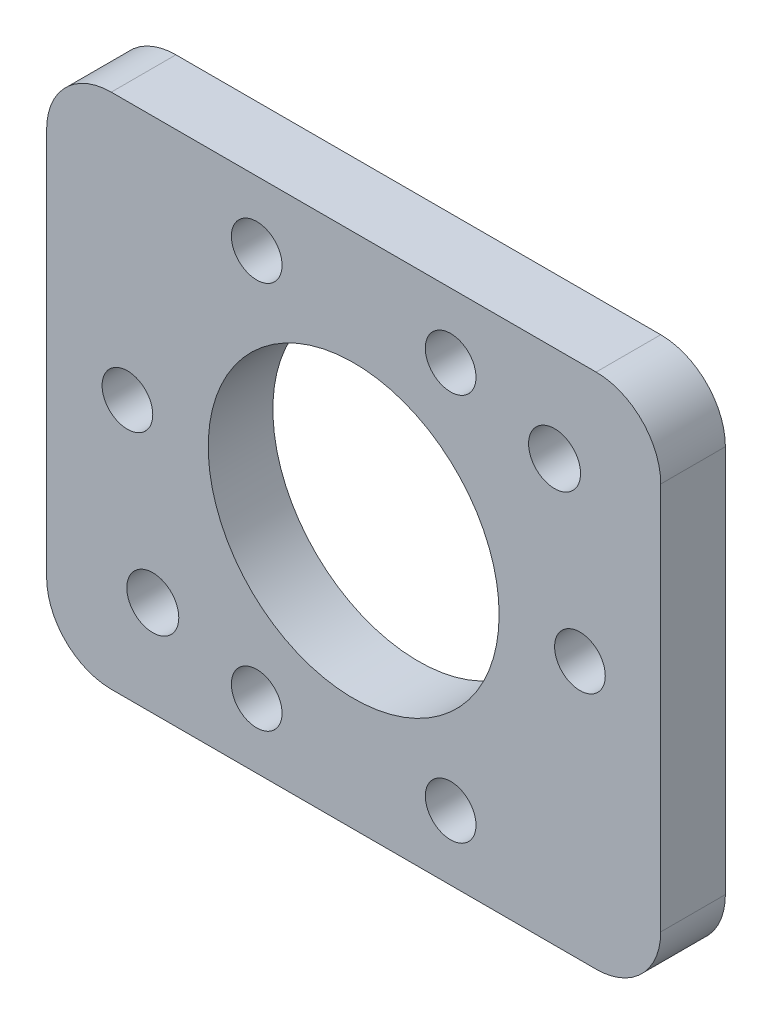
ISO-10303-21;
HEADER;
FILE_DESCRIPTION(('STEP AP214'),'2;1');
FILE_NAME('part.step','',(''),(''),'','','');
FILE_SCHEMA(('AUTOMOTIVE_DESIGN { 1 0 10303 214 1 1 1 1 }'));
ENDSEC;
DATA;
#1=APPLICATION_CONTEXT('core data for automotive mechanical design processes');
#2=APPLICATION_PROTOCOL_DEFINITION('international standard','automotive_design',2000,#1);
#3=PRODUCT_CONTEXT('',#1,'mechanical');
#4=PRODUCT('Part','Part','',(#3));
#5=PRODUCT_RELATED_PRODUCT_CATEGORY('part','',(#4));
#6=PRODUCT_DEFINITION_FORMATION('','',#4);
#7=PRODUCT_DEFINITION_CONTEXT('part definition',#1,'design');
#8=PRODUCT_DEFINITION('design','',#6,#7);
#9=PRODUCT_DEFINITION_SHAPE('','',#8);
#10=(LENGTH_UNIT() NAMED_UNIT(*) SI_UNIT(.MILLI.,.METRE.));
#11=(NAMED_UNIT(*) PLANE_ANGLE_UNIT() SI_UNIT($,.RADIAN.));
#12=(NAMED_UNIT(*) SI_UNIT($,.STERADIAN.) SOLID_ANGLE_UNIT());
#13=UNCERTAINTY_MEASURE_WITH_UNIT(LENGTH_MEASURE(1.E-05),#10,'distance_accuracy_value','');
#14=(GEOMETRIC_REPRESENTATION_CONTEXT(3) GLOBAL_UNCERTAINTY_ASSIGNED_CONTEXT((#13)) GLOBAL_UNIT_ASSIGNED_CONTEXT((#10,
#11,#12)) REPRESENTATION_CONTEXT('',''));
#15=CARTESIAN_POINT('',(0.,0.,0.));
#16=DIRECTION('',(0.,0.,1.));
#17=DIRECTION('',(1.,0.,0.));
#18=AXIS2_PLACEMENT_3D('',#15,#16,#17);
#19=CARTESIAN_POINT('',(30.1625,0.,6.35));
#20=DIRECTION('',(1.,0.,0.));
#21=DIRECTION('',(0.,1.,0.));
#22=AXIS2_PLACEMENT_3D('',#19,#20,#21);
#23=PLANE('',#22);
#24=DIRECTION('',(0.,-1.,0.));
#25=VECTOR('',#24,1.);
#26=CARTESIAN_POINT('',(30.1625,0.,0.));
#27=LINE('',#26,#25);
#28=CARTESIAN_POINT('',(30.1625,19.05,0.));
#29=VERTEX_POINT('',#28);
#30=CARTESIAN_POINT('',(30.1625,-19.05,0.));
#31=VERTEX_POINT('',#30);
#32=EDGE_CURVE('E125',#29,#31,#27,.T.);
#33=ORIENTED_EDGE('',*,*,#32,.F.);
#34=DIRECTION('',(0.,0.,-1.));
#35=VECTOR('',#34,1.);
#36=CARTESIAN_POINT('',(30.1625,19.05,6.35));
#37=LINE('',#36,#35);
#38=CARTESIAN_POINT('',(30.1625,19.05,6.35));
#39=VERTEX_POINT('',#38);
#40=EDGE_CURVE('E146',#29,#39,#37,.F.);
#41=ORIENTED_EDGE('',*,*,#40,.T.);
#42=DIRECTION('',(0.,-1.,0.));
#43=VECTOR('',#42,1.);
#44=CARTESIAN_POINT('',(30.1625,0.,6.35));
#45=LINE('',#44,#43);
#46=CARTESIAN_POINT('',(30.1625,-19.05,6.35));
#47=VERTEX_POINT('',#46);
#48=EDGE_CURVE('E163',#39,#47,#45,.T.);
#49=ORIENTED_EDGE('',*,*,#48,.T.);
#50=DIRECTION('',(0.,0.,-1.));
#51=VECTOR('',#50,1.);
#52=CARTESIAN_POINT('',(30.1625,-19.05,0.));
#53=LINE('',#52,#51);
#54=EDGE_CURVE('E143',#47,#31,#53,.T.);
#55=ORIENTED_EDGE('',*,*,#54,.T.);
#56=EDGE_LOOP('',(#33,#41,#49,#55));
#57=FACE_BOUND('',#56,.T.);
#58=ADVANCED_FACE('F39',(#57),#23,.T.);
#59=CARTESIAN_POINT('',(0.,25.4,6.35));
#60=DIRECTION('',(0.,1.,0.));
#61=DIRECTION('',(0.,0.,1.));
#62=AXIS2_PLACEMENT_3D('',#59,#60,#61);
#63=PLANE('',#62);
#64=DIRECTION('',(1.,0.,0.));
#65=VECTOR('',#64,1.);
#66=CARTESIAN_POINT('',(0.,25.4,6.35));
#67=LINE('',#66,#65);
#68=CARTESIAN_POINT('',(-23.8125,25.4,6.35));
#69=VERTEX_POINT('',#68);
#70=CARTESIAN_POINT('',(23.8125,25.4,6.35));
#71=VERTEX_POINT('',#70);
#72=EDGE_CURVE('E161',#69,#71,#67,.T.);
#73=ORIENTED_EDGE('',*,*,#72,.T.);
#74=DIRECTION('',(0.,0.,-1.));
#75=VECTOR('',#74,1.);
#76=CARTESIAN_POINT('',(23.8125,25.4,6.35));
#77=LINE('',#76,#75);
#78=CARTESIAN_POINT('',(23.8125,25.4,0.));
#79=VERTEX_POINT('',#78);
#80=EDGE_CURVE('E116',#71,#79,#77,.T.);
#81=ORIENTED_EDGE('',*,*,#80,.T.);
#82=DIRECTION('',(1.,0.,0.));
#83=VECTOR('',#82,1.);
#84=CARTESIAN_POINT('',(0.,25.4,0.));
#85=LINE('',#84,#83);
#86=CARTESIAN_POINT('',(-23.8125,25.4,0.));
#87=VERTEX_POINT('',#86);
#88=EDGE_CURVE('E108',#87,#79,#85,.T.);
#89=ORIENTED_EDGE('',*,*,#88,.F.);
#90=DIRECTION('',(0.,0.,-1.));
#91=VECTOR('',#90,1.);
#92=CARTESIAN_POINT('',(-23.8125,25.4,6.35));
#93=LINE('',#92,#91);
#94=EDGE_CURVE('E122',#87,#69,#93,.F.);
#95=ORIENTED_EDGE('',*,*,#94,.T.);
#96=EDGE_LOOP('',(#73,#81,#89,#95));
#97=FACE_BOUND('',#96,.T.);
#98=ADVANCED_FACE('F121',(#97),#63,.T.);
#99=CARTESIAN_POINT('',(-30.1625,0.,6.35));
#100=DIRECTION('',(1.,0.,0.));
#101=DIRECTION('',(0.,1.,0.));
#102=AXIS2_PLACEMENT_3D('',#99,#100,#101);
#103=PLANE('',#102);
#104=DIRECTION('',(0.,-1.,0.));
#105=VECTOR('',#104,1.);
#106=CARTESIAN_POINT('',(-30.1625,0.,0.));
#107=LINE('',#106,#105);
#108=CARTESIAN_POINT('',(-30.1625,19.05,0.));
#109=VERTEX_POINT('',#108);
#110=CARTESIAN_POINT('',(-30.1625,-19.05,0.));
#111=VERTEX_POINT('',#110);
#112=EDGE_CURVE('E110',#109,#111,#107,.T.);
#113=ORIENTED_EDGE('',*,*,#112,.T.);
#114=DIRECTION('',(0.,0.,-1.));
#115=VECTOR('',#114,1.);
#116=CARTESIAN_POINT('',(-30.1625,-19.05,6.35));
#117=LINE('',#116,#115);
#118=CARTESIAN_POINT('',(-30.1625,-19.05,6.35));
#119=VERTEX_POINT('',#118);
#120=EDGE_CURVE('E11',#111,#119,#117,.F.);
#121=ORIENTED_EDGE('',*,*,#120,.T.);
#122=DIRECTION('',(0.,-1.,0.));
#123=VECTOR('',#122,1.);
#124=CARTESIAN_POINT('',(-30.1625,0.,6.35));
#125=LINE('',#124,#123);
#126=CARTESIAN_POINT('',(-30.1625,19.05,6.35));
#127=VERTEX_POINT('',#126);
#128=EDGE_CURVE('E132',#127,#119,#125,.T.);
#129=ORIENTED_EDGE('',*,*,#128,.F.);
#130=DIRECTION('',(0.,0.,-1.));
#131=VECTOR('',#130,1.);
#132=CARTESIAN_POINT('',(-30.1625,19.05,0.));
#133=LINE('',#132,#131);
#134=EDGE_CURVE('E47',#127,#109,#133,.T.);
#135=ORIENTED_EDGE('',*,*,#134,.T.);
#136=EDGE_LOOP('',(#113,#121,#129,#135));
#137=FACE_BOUND('',#136,.T.);
#138=ADVANCED_FACE('F159',(#137),#103,.F.);
#139=CARTESIAN_POINT('',(0.,0.,6.35));
#140=DIRECTION('',(0.,0.,-1.));
#141=DIRECTION('',(-1.,0.,0.));
#142=AXIS2_PLACEMENT_3D('',#139,#140,#141);
#143=CYLINDRICAL_SURFACE('',#142,14.2875);
#144=CARTESIAN_POINT('',(0.,0.,6.35));
#145=DIRECTION('',(0.,0.,1.));
#146=DIRECTION('',(1.,0.,0.));
#147=AXIS2_PLACEMENT_3D('',#144,#145,#146);
#148=CIRCLE('',#147,14.2875);
#149=CARTESIAN_POINT('',(14.2875,0.,6.35));
#150=VERTEX_POINT('',#149);
#151=EDGE_CURVE('E223',#150,#150,#148,.T.);
#152=ORIENTED_EDGE('',*,*,#151,.T.);
#153=EDGE_LOOP('',(#152));
#154=FACE_BOUND('',#153,.T.);
#155=CARTESIAN_POINT('',(0.,0.,0.));
#156=DIRECTION('',(0.,0.,1.));
#157=DIRECTION('',(1.,0.,0.));
#158=AXIS2_PLACEMENT_3D('',#155,#156,#157);
#159=CIRCLE('',#158,14.2875);
#160=CARTESIAN_POINT('',(14.2875,0.,0.));
#161=VERTEX_POINT('',#160);
#162=EDGE_CURVE('E191',#161,#161,#159,.T.);
#163=ORIENTED_EDGE('',*,*,#162,.F.);
#164=EDGE_LOOP('',(#163));
#165=FACE_BOUND('',#164,.T.);
#166=ADVANCED_FACE('F259',(#154,#165),#143,.F.);
#167=CARTESIAN_POINT('',(19.7317953386694,15.9942568665401,6.35));
#168=DIRECTION('',(0.,0.,-1.));
#169=DIRECTION('',(-1.,0.,0.));
#170=AXIS2_PLACEMENT_3D('',#167,#168,#169);
#171=CYLINDRICAL_SURFACE('',#170,2.5527);
#172=CARTESIAN_POINT('',(19.7317953386694,15.9942568665401,6.35));
#173=DIRECTION('',(0.,0.,1.));
#174=DIRECTION('',(1.,0.,0.));
#175=AXIS2_PLACEMENT_3D('',#172,#173,#174);
#176=CIRCLE('',#175,2.5527);
#177=CARTESIAN_POINT('',(22.2844953386694,15.9942568665401,6.35));
#178=VERTEX_POINT('',#177);
#179=EDGE_CURVE('E220',#178,#178,#176,.T.);
#180=ORIENTED_EDGE('',*,*,#179,.T.);
#181=EDGE_LOOP('',(#180));
#182=FACE_BOUND('',#181,.T.);
#183=CARTESIAN_POINT('',(19.7317953386694,15.9942568665401,0.));
#184=DIRECTION('',(0.,0.,1.));
#185=DIRECTION('',(1.,0.,0.));
#186=AXIS2_PLACEMENT_3D('',#183,#184,#185);
#187=CIRCLE('',#186,2.5527);
#188=CARTESIAN_POINT('',(22.2844953386694,15.9942568665401,0.));
#189=VERTEX_POINT('',#188);
#190=EDGE_CURVE('E188',#189,#189,#187,.T.);
#191=ORIENTED_EDGE('',*,*,#190,.F.);
#192=EDGE_LOOP('',(#191));
#193=FACE_BOUND('',#192,.T.);
#194=ADVANCED_FACE('F262',(#182,#193),#171,.F.);
#195=CARTESIAN_POINT('',(-19.7317953386694,-15.9942568665401,6.35));
#196=DIRECTION('',(0.,0.,-1.));
#197=DIRECTION('',(-1.,0.,0.));
#198=AXIS2_PLACEMENT_3D('',#195,#196,#197);
#199=CYLINDRICAL_SURFACE('',#198,2.5527);
#200=CARTESIAN_POINT('',(-19.7317953386694,-15.9942568665401,6.35));
#201=DIRECTION('',(0.,0.,1.));
#202=DIRECTION('',(1.,0.,0.));
#203=AXIS2_PLACEMENT_3D('',#200,#201,#202);
#204=CIRCLE('',#203,2.5527);
#205=CARTESIAN_POINT('',(-17.1790953386694,-15.9942568665401,6.35));
#206=VERTEX_POINT('',#205);
#207=EDGE_CURVE('E217',#206,#206,#204,.T.);
#208=ORIENTED_EDGE('',*,*,#207,.T.);
#209=EDGE_LOOP('',(#208));
#210=FACE_BOUND('',#209,.T.);
#211=CARTESIAN_POINT('',(-19.7317953386694,-15.9942568665401,0.));
#212=DIRECTION('',(0.,0.,1.));
#213=DIRECTION('',(1.,0.,0.));
#214=AXIS2_PLACEMENT_3D('',#211,#212,#213);
#215=CIRCLE('',#214,2.5527);
#216=CARTESIAN_POINT('',(-17.1790953386694,-15.9942568665401,0.));
#217=VERTEX_POINT('',#216);
#218=EDGE_CURVE('E185',#217,#217,#215,.T.);
#219=ORIENTED_EDGE('',*,*,#218,.F.);
#220=EDGE_LOOP('',(#219));
#221=FACE_BOUND('',#220,.T.);
#222=ADVANCED_FACE('F266',(#210,#221),#199,.F.);
#223=CARTESIAN_POINT('',(-22.225,0.,6.35));
#224=DIRECTION('',(0.,0.,-1.));
#225=DIRECTION('',(-1.,0.,0.));
#226=AXIS2_PLACEMENT_3D('',#223,#224,#225);
#227=CYLINDRICAL_SURFACE('',#226,2.4892);
#228=CARTESIAN_POINT('',(-22.225,0.,6.35));
#229=DIRECTION('',(0.,0.,1.));
#230=DIRECTION('',(1.,0.,0.));
#231=AXIS2_PLACEMENT_3D('',#228,#229,#230);
#232=CIRCLE('',#231,2.4892);
#233=CARTESIAN_POINT('',(-19.7358,0.,6.35));
#234=VERTEX_POINT('',#233);
#235=EDGE_CURVE('E214',#234,#234,#232,.T.);
#236=ORIENTED_EDGE('',*,*,#235,.T.);
#237=EDGE_LOOP('',(#236));
#238=FACE_BOUND('',#237,.T.);
#239=CARTESIAN_POINT('',(-22.225,0.,0.));
#240=DIRECTION('',(0.,0.,1.));
#241=DIRECTION('',(1.,0.,0.));
#242=AXIS2_PLACEMENT_3D('',#239,#240,#241);
#243=CIRCLE('',#242,2.4892);
#244=CARTESIAN_POINT('',(-19.7358,0.,0.));
#245=VERTEX_POINT('',#244);
#246=EDGE_CURVE('E182',#245,#245,#243,.T.);
#247=ORIENTED_EDGE('',*,*,#246,.F.);
#248=EDGE_LOOP('',(#247));
#249=FACE_BOUND('',#248,.T.);
#250=ADVANCED_FACE('F270',(#238,#249),#227,.F.);
#251=CARTESIAN_POINT('',(22.225,0.,6.35));
#252=DIRECTION('',(0.,0.,-1.));
#253=DIRECTION('',(-1.,0.,0.));
#254=AXIS2_PLACEMENT_3D('',#251,#252,#253);
#255=CYLINDRICAL_SURFACE('',#254,2.4892);
#256=CARTESIAN_POINT('',(22.225,0.,6.35));
#257=DIRECTION('',(0.,0.,1.));
#258=DIRECTION('',(1.,0.,0.));
#259=AXIS2_PLACEMENT_3D('',#256,#257,#258);
#260=CIRCLE('',#259,2.4892);
#261=CARTESIAN_POINT('',(24.7142,0.,6.35));
#262=VERTEX_POINT('',#261);
#263=EDGE_CURVE('E211',#262,#262,#260,.T.);
#264=ORIENTED_EDGE('',*,*,#263,.T.);
#265=EDGE_LOOP('',(#264));
#266=FACE_BOUND('',#265,.T.);
#267=CARTESIAN_POINT('',(22.225,0.,0.));
#268=DIRECTION('',(0.,0.,1.));
#269=DIRECTION('',(1.,0.,0.));
#270=AXIS2_PLACEMENT_3D('',#267,#268,#269);
#271=CIRCLE('',#270,2.4892);
#272=CARTESIAN_POINT('',(24.7142,0.,0.));
#273=VERTEX_POINT('',#272);
#274=EDGE_CURVE('E179',#273,#273,#271,.T.);
#275=ORIENTED_EDGE('',*,*,#274,.F.);
#276=EDGE_LOOP('',(#275));
#277=FACE_BOUND('',#276,.T.);
#278=ADVANCED_FACE('F274',(#266,#277),#255,.F.);
#279=CARTESIAN_POINT('',(-9.525,19.05,6.35));
#280=DIRECTION('',(0.,0.,-1.));
#281=DIRECTION('',(-1.,0.,0.));
#282=AXIS2_PLACEMENT_3D('',#279,#280,#281);
#283=CYLINDRICAL_SURFACE('',#282,2.48920000000003);
#284=CARTESIAN_POINT('',(-9.525,19.05,6.35));
#285=DIRECTION('',(0.,0.,1.));
#286=DIRECTION('',(1.,0.,0.));
#287=AXIS2_PLACEMENT_3D('',#284,#285,#286);
#288=CIRCLE('',#287,2.48920000000003);
#289=CARTESIAN_POINT('',(-7.03579999999997,19.05,6.35));
#290=VERTEX_POINT('',#289);
#291=EDGE_CURVE('E208',#290,#290,#288,.T.);
#292=ORIENTED_EDGE('',*,*,#291,.T.);
#293=EDGE_LOOP('',(#292));
#294=FACE_BOUND('',#293,.T.);
#295=CARTESIAN_POINT('',(-9.525,19.05,0.));
#296=DIRECTION('',(0.,0.,1.));
#297=DIRECTION('',(1.,0.,0.));
#298=AXIS2_PLACEMENT_3D('',#295,#296,#297);
#299=CIRCLE('',#298,2.48920000000003);
#300=CARTESIAN_POINT('',(-7.03579999999997,19.05,0.));
#301=VERTEX_POINT('',#300);
#302=EDGE_CURVE('E176',#301,#301,#299,.T.);
#303=ORIENTED_EDGE('',*,*,#302,.F.);
#304=EDGE_LOOP('',(#303));
#305=FACE_BOUND('',#304,.T.);
#306=ADVANCED_FACE('F278',(#294,#305),#283,.F.);
#307=CARTESIAN_POINT('',(9.525,19.05,6.35));
#308=DIRECTION('',(0.,0.,-1.));
#309=DIRECTION('',(-1.,0.,0.));
#310=AXIS2_PLACEMENT_3D('',#307,#308,#309);
#311=CYLINDRICAL_SURFACE('',#310,2.48920000000001);
#312=CARTESIAN_POINT('',(9.525,19.05,6.35));
#313=DIRECTION('',(0.,0.,1.));
#314=DIRECTION('',(1.,0.,0.));
#315=AXIS2_PLACEMENT_3D('',#312,#313,#314);
#316=CIRCLE('',#315,2.48920000000001);
#317=CARTESIAN_POINT('',(12.0142,19.05,6.35));
#318=VERTEX_POINT('',#317);
#319=EDGE_CURVE('E203',#318,#318,#316,.T.);
#320=ORIENTED_EDGE('',*,*,#319,.T.);
#321=EDGE_LOOP('',(#320));
#322=FACE_BOUND('',#321,.T.);
#323=CARTESIAN_POINT('',(9.525,19.05,0.));
#324=DIRECTION('',(0.,0.,1.));
#325=DIRECTION('',(1.,0.,0.));
#326=AXIS2_PLACEMENT_3D('',#323,#324,#325);
#327=CIRCLE('',#326,2.48920000000001);
#328=CARTESIAN_POINT('',(12.0142,19.05,0.));
#329=VERTEX_POINT('',#328);
#330=EDGE_CURVE('E173',#329,#329,#327,.T.);
#331=ORIENTED_EDGE('',*,*,#330,.F.);
#332=EDGE_LOOP('',(#331));
#333=FACE_BOUND('',#332,.T.);
#334=ADVANCED_FACE('F282',(#322,#333),#311,.F.);
#335=CARTESIAN_POINT('',(9.525,-19.05,6.35));
#336=DIRECTION('',(0.,0.,-1.));
#337=DIRECTION('',(-1.,0.,0.));
#338=AXIS2_PLACEMENT_3D('',#335,#336,#337);
#339=CYLINDRICAL_SURFACE('',#338,2.48920000000001);
#340=CARTESIAN_POINT('',(9.525,-19.05,6.35));
#341=DIRECTION('',(0.,0.,1.));
#342=DIRECTION('',(1.,0.,0.));
#343=AXIS2_PLACEMENT_3D('',#340,#341,#342);
#344=CIRCLE('',#343,2.48920000000001);
#345=CARTESIAN_POINT('',(12.0142,-19.05,6.35));
#346=VERTEX_POINT('',#345);
#347=EDGE_CURVE('E198',#346,#346,#344,.T.);
#348=ORIENTED_EDGE('',*,*,#347,.T.);
#349=EDGE_LOOP('',(#348));
#350=FACE_BOUND('',#349,.T.);
#351=CARTESIAN_POINT('',(9.525,-19.05,0.));
#352=DIRECTION('',(0.,0.,1.));
#353=DIRECTION('',(1.,0.,0.));
#354=AXIS2_PLACEMENT_3D('',#351,#352,#353);
#355=CIRCLE('',#354,2.48920000000001);
#356=CARTESIAN_POINT('',(12.0142,-19.05,0.));
#357=VERTEX_POINT('',#356);
#358=EDGE_CURVE('E170',#357,#357,#355,.T.);
#359=ORIENTED_EDGE('',*,*,#358,.F.);
#360=EDGE_LOOP('',(#359));
#361=FACE_BOUND('',#360,.T.);
#362=ADVANCED_FACE('F286',(#350,#361),#339,.F.);
#363=CARTESIAN_POINT('',(-9.525,-19.05,6.35));
#364=DIRECTION('',(0.,0.,-1.));
#365=DIRECTION('',(-1.,0.,0.));
#366=AXIS2_PLACEMENT_3D('',#363,#364,#365);
#367=CYLINDRICAL_SURFACE('',#366,2.48920000000003);
#368=CARTESIAN_POINT('',(-9.525,-19.05,6.35));
#369=DIRECTION('',(0.,0.,1.));
#370=DIRECTION('',(1.,0.,0.));
#371=AXIS2_PLACEMENT_3D('',#368,#369,#370);
#372=CIRCLE('',#371,2.48920000000003);
#373=CARTESIAN_POINT('',(-7.03579999999997,-19.05,6.35));
#374=VERTEX_POINT('',#373);
#375=EDGE_CURVE('E195',#374,#374,#372,.T.);
#376=ORIENTED_EDGE('',*,*,#375,.T.);
#377=EDGE_LOOP('',(#376));
#378=FACE_BOUND('',#377,.T.);
#379=CARTESIAN_POINT('',(-9.525,-19.05,0.));
#380=DIRECTION('',(0.,0.,1.));
#381=DIRECTION('',(1.,0.,0.));
#382=AXIS2_PLACEMENT_3D('',#379,#380,#381);
#383=CIRCLE('',#382,2.48920000000003);
#384=CARTESIAN_POINT('',(-7.03579999999997,-19.05,0.));
#385=VERTEX_POINT('',#384);
#386=EDGE_CURVE('E167',#385,#385,#383,.T.);
#387=ORIENTED_EDGE('',*,*,#386,.F.);
#388=EDGE_LOOP('',(#387));
#389=FACE_BOUND('',#388,.T.);
#390=ADVANCED_FACE('F248',(#378,#389),#367,.F.);
#391=CARTESIAN_POINT('',(0.,-25.4,6.35));
#392=DIRECTION('',(0.,1.,0.));
#393=DIRECTION('',(0.,0.,1.));
#394=AXIS2_PLACEMENT_3D('',#391,#392,#393);
#395=PLANE('',#394);
#396=DIRECTION('',(1.,0.,0.));
#397=VECTOR('',#396,1.);
#398=CARTESIAN_POINT('',(0.,-25.4,0.));
#399=LINE('',#398,#397);
#400=CARTESIAN_POINT('',(-23.8125,-25.4,0.));
#401=VERTEX_POINT('',#400);
#402=CARTESIAN_POINT('',(23.8125,-25.4,0.));
#403=VERTEX_POINT('',#402);
#404=EDGE_CURVE('E135',#401,#403,#399,.T.);
#405=ORIENTED_EDGE('',*,*,#404,.T.);
#406=DIRECTION('',(0.,0.,-1.));
#407=VECTOR('',#406,1.);
#408=CARTESIAN_POINT('',(23.8125,-25.4,6.35));
#409=LINE('',#408,#407);
#410=CARTESIAN_POINT('',(23.8125,-25.4,6.35));
#411=VERTEX_POINT('',#410);
#412=EDGE_CURVE('E54',#403,#411,#409,.F.);
#413=ORIENTED_EDGE('',*,*,#412,.T.);
#414=DIRECTION('',(1.,0.,0.));
#415=VECTOR('',#414,1.);
#416=CARTESIAN_POINT('',(0.,-25.4,6.35));
#417=LINE('',#416,#415);
#418=CARTESIAN_POINT('',(-23.8125,-25.4,6.35));
#419=VERTEX_POINT('',#418);
#420=EDGE_CURVE('E129',#419,#411,#417,.T.);
#421=ORIENTED_EDGE('',*,*,#420,.F.);
#422=DIRECTION('',(0.,0.,-1.));
#423=VECTOR('',#422,1.);
#424=CARTESIAN_POINT('',(-23.8125,-25.4,6.35));
#425=LINE('',#424,#423);
#426=EDGE_CURVE('E154',#419,#401,#425,.T.);
#427=ORIENTED_EDGE('',*,*,#426,.T.);
#428=EDGE_LOOP('',(#405,#413,#421,#427));
#429=FACE_BOUND('',#428,.T.);
#430=ADVANCED_FACE('F239',(#429),#395,.F.);
#431=CARTESIAN_POINT('',(0.,0.,6.35));
#432=DIRECTION('',(0.,0.,1.));
#433=DIRECTION('',(1.,0.,0.));
#434=AXIS2_PLACEMENT_3D('',#431,#432,#433);
#435=PLANE('',#434);
#436=ORIENTED_EDGE('',*,*,#375,.F.);
#437=EDGE_LOOP('',(#436));
#438=FACE_BOUND('',#437,.T.);
#439=ORIENTED_EDGE('',*,*,#347,.F.);
#440=EDGE_LOOP('',(#439));
#441=FACE_BOUND('',#440,.T.);
#442=ORIENTED_EDGE('',*,*,#319,.F.);
#443=EDGE_LOOP('',(#442));
#444=FACE_BOUND('',#443,.T.);
#445=ORIENTED_EDGE('',*,*,#291,.F.);
#446=EDGE_LOOP('',(#445));
#447=FACE_BOUND('',#446,.T.);
#448=ORIENTED_EDGE('',*,*,#263,.F.);
#449=EDGE_LOOP('',(#448));
#450=FACE_BOUND('',#449,.T.);
#451=ORIENTED_EDGE('',*,*,#235,.F.);
#452=EDGE_LOOP('',(#451));
#453=FACE_BOUND('',#452,.T.);
#454=ORIENTED_EDGE('',*,*,#207,.F.);
#455=EDGE_LOOP('',(#454));
#456=FACE_BOUND('',#455,.T.);
#457=ORIENTED_EDGE('',*,*,#179,.F.);
#458=EDGE_LOOP('',(#457));
#459=FACE_BOUND('',#458,.T.);
#460=ORIENTED_EDGE('',*,*,#151,.F.);
#461=EDGE_LOOP('',(#460));
#462=FACE_BOUND('',#461,.T.);
#463=ORIENTED_EDGE('',*,*,#48,.F.);
#464=CARTESIAN_POINT('',(23.8125,19.05,6.35));
#465=DIRECTION('',(0.,0.,1.));
#466=DIRECTION('',(1.,0.,0.));
#467=AXIS2_PLACEMENT_3D('',#464,#465,#466);
#468=CIRCLE('',#467,6.35);
#469=EDGE_CURVE('E152',#39,#71,#468,.T.);
#470=ORIENTED_EDGE('',*,*,#469,.T.);
#471=ORIENTED_EDGE('',*,*,#72,.F.);
#472=CARTESIAN_POINT('',(-23.8125,19.05,6.35));
#473=DIRECTION('',(0.,0.,1.));
#474=DIRECTION('',(1.,0.,0.));
#475=AXIS2_PLACEMENT_3D('',#472,#473,#474);
#476=CIRCLE('',#475,6.35);
#477=EDGE_CURVE('E128',#69,#127,#476,.T.);
#478=ORIENTED_EDGE('',*,*,#477,.T.);
#479=ORIENTED_EDGE('',*,*,#128,.T.);
#480=CARTESIAN_POINT('',(-23.8125,-19.05,6.35));
#481=DIRECTION('',(0.,0.,1.));
#482=DIRECTION('',(1.,0.,0.));
#483=AXIS2_PLACEMENT_3D('',#480,#481,#482);
#484=CIRCLE('',#483,6.35);
#485=EDGE_CURVE('E61',#119,#419,#484,.T.);
#486=ORIENTED_EDGE('',*,*,#485,.T.);
#487=ORIENTED_EDGE('',*,*,#420,.T.);
#488=CARTESIAN_POINT('',(23.8125,-19.05,6.35));
#489=DIRECTION('',(0.,0.,1.));
#490=DIRECTION('',(1.,0.,0.));
#491=AXIS2_PLACEMENT_3D('',#488,#489,#490);
#492=CIRCLE('',#491,6.35);
#493=EDGE_CURVE('E150',#411,#47,#492,.T.);
#494=ORIENTED_EDGE('',*,*,#493,.T.);
#495=EDGE_LOOP('',(#463,#470,#471,#478,#479,#486,#487,#494));
#496=FACE_BOUND('',#495,.T.);
#497=ADVANCED_FACE('F237',(#438,#441,#444,#447,#450,#453,#456,#459,#462,#496),#435,.T.);
#498=CARTESIAN_POINT('',(0.,0.,0.));
#499=DIRECTION('',(0.,0.,1.));
#500=DIRECTION('',(1.,0.,0.));
#501=AXIS2_PLACEMENT_3D('',#498,#499,#500);
#502=PLANE('',#501);
#503=ORIENTED_EDGE('',*,*,#386,.T.);
#504=EDGE_LOOP('',(#503));
#505=FACE_BOUND('',#504,.T.);
#506=ORIENTED_EDGE('',*,*,#358,.T.);
#507=EDGE_LOOP('',(#506));
#508=FACE_BOUND('',#507,.T.);
#509=ORIENTED_EDGE('',*,*,#330,.T.);
#510=EDGE_LOOP('',(#509));
#511=FACE_BOUND('',#510,.T.);
#512=ORIENTED_EDGE('',*,*,#302,.T.);
#513=EDGE_LOOP('',(#512));
#514=FACE_BOUND('',#513,.T.);
#515=ORIENTED_EDGE('',*,*,#274,.T.);
#516=EDGE_LOOP('',(#515));
#517=FACE_BOUND('',#516,.T.);
#518=ORIENTED_EDGE('',*,*,#246,.T.);
#519=EDGE_LOOP('',(#518));
#520=FACE_BOUND('',#519,.T.);
#521=ORIENTED_EDGE('',*,*,#218,.T.);
#522=EDGE_LOOP('',(#521));
#523=FACE_BOUND('',#522,.T.);
#524=ORIENTED_EDGE('',*,*,#190,.T.);
#525=EDGE_LOOP('',(#524));
#526=FACE_BOUND('',#525,.T.);
#527=ORIENTED_EDGE('',*,*,#162,.T.);
#528=EDGE_LOOP('',(#527));
#529=FACE_BOUND('',#528,.T.);
#530=ORIENTED_EDGE('',*,*,#88,.T.);
#531=CARTESIAN_POINT('',(23.8125,19.05,0.));
#532=DIRECTION('',(0.,0.,1.));
#533=DIRECTION('',(1.,0.,0.));
#534=AXIS2_PLACEMENT_3D('',#531,#532,#533);
#535=CIRCLE('',#534,6.35);
#536=EDGE_CURVE('E141',#79,#29,#535,.F.);
#537=ORIENTED_EDGE('',*,*,#536,.T.);
#538=ORIENTED_EDGE('',*,*,#32,.T.);
#539=CARTESIAN_POINT('',(23.8125,-19.05,0.));
#540=DIRECTION('',(0.,0.,1.));
#541=DIRECTION('',(1.,0.,0.));
#542=AXIS2_PLACEMENT_3D('',#539,#540,#541);
#543=CIRCLE('',#542,6.35);
#544=EDGE_CURVE('E139',#31,#403,#543,.F.);
#545=ORIENTED_EDGE('',*,*,#544,.T.);
#546=ORIENTED_EDGE('',*,*,#404,.F.);
#547=CARTESIAN_POINT('',(-23.8125,-19.05,0.));
#548=DIRECTION('',(0.,0.,1.));
#549=DIRECTION('',(1.,0.,0.));
#550=AXIS2_PLACEMENT_3D('',#547,#548,#549);
#551=CIRCLE('',#550,6.35);
#552=EDGE_CURVE('E115',#401,#111,#551,.F.);
#553=ORIENTED_EDGE('',*,*,#552,.T.);
#554=ORIENTED_EDGE('',*,*,#112,.F.);
#555=CARTESIAN_POINT('',(-23.8125,19.05,0.));
#556=DIRECTION('',(0.,0.,1.));
#557=DIRECTION('',(1.,0.,0.));
#558=AXIS2_PLACEMENT_3D('',#555,#556,#557);
#559=CIRCLE('',#558,6.35);
#560=EDGE_CURVE('E105',#109,#87,#559,.F.);
#561=ORIENTED_EDGE('',*,*,#560,.T.);
#562=EDGE_LOOP('',(#530,#537,#538,#545,#546,#553,#554,#561));
#563=FACE_BOUND('',#562,.T.);
#564=ADVANCED_FACE('F107',(#505,#508,#511,#514,#517,#520,#523,#526,#529,#563),#502,.F.);
#565=CARTESIAN_POINT('',(23.8125,19.05,6.35));
#566=DIRECTION('',(0.,0.,-1.));
#567=DIRECTION('',(-1.,0.,0.));
#568=AXIS2_PLACEMENT_3D('',#565,#566,#567);
#569=CYLINDRICAL_SURFACE('',#568,6.35);
#570=ORIENTED_EDGE('',*,*,#469,.F.);
#571=ORIENTED_EDGE('',*,*,#40,.F.);
#572=ORIENTED_EDGE('',*,*,#536,.F.);
#573=ORIENTED_EDGE('',*,*,#80,.F.);
#574=EDGE_LOOP('',(#570,#571,#572,#573));
#575=FACE_BOUND('',#574,.T.);
#576=ADVANCED_FACE('F236',(#575),#569,.T.);
#577=CARTESIAN_POINT('',(23.8125,-19.05,6.35));
#578=DIRECTION('',(0.,0.,1.));
#579=DIRECTION('',(1.,0.,0.));
#580=AXIS2_PLACEMENT_3D('',#577,#578,#579);
#581=CYLINDRICAL_SURFACE('',#580,6.35);
#582=ORIENTED_EDGE('',*,*,#493,.F.);
#583=ORIENTED_EDGE('',*,*,#412,.F.);
#584=ORIENTED_EDGE('',*,*,#544,.F.);
#585=ORIENTED_EDGE('',*,*,#54,.F.);
#586=EDGE_LOOP('',(#582,#583,#584,#585));
#587=FACE_BOUND('',#586,.T.);
#588=ADVANCED_FACE('F234',(#587),#581,.T.);
#589=CARTESIAN_POINT('',(-23.8125,-19.05,6.35));
#590=DIRECTION('',(0.,0.,-1.));
#591=DIRECTION('',(-1.,0.,0.));
#592=AXIS2_PLACEMENT_3D('',#589,#590,#591);
#593=CYLINDRICAL_SURFACE('',#592,6.35);
#594=ORIENTED_EDGE('',*,*,#485,.F.);
#595=ORIENTED_EDGE('',*,*,#120,.F.);
#596=ORIENTED_EDGE('',*,*,#552,.F.);
#597=ORIENTED_EDGE('',*,*,#426,.F.);
#598=EDGE_LOOP('',(#594,#595,#596,#597));
#599=FACE_BOUND('',#598,.T.);
#600=ADVANCED_FACE('F296',(#599),#593,.T.);
#601=CARTESIAN_POINT('',(-23.8125,19.05,6.35));
#602=DIRECTION('',(0.,0.,1.));
#603=DIRECTION('',(1.,0.,0.));
#604=AXIS2_PLACEMENT_3D('',#601,#602,#603);
#605=CYLINDRICAL_SURFACE('',#604,6.35);
#606=ORIENTED_EDGE('',*,*,#477,.F.);
#607=ORIENTED_EDGE('',*,*,#94,.F.);
#608=ORIENTED_EDGE('',*,*,#560,.F.);
#609=ORIENTED_EDGE('',*,*,#134,.F.);
#610=EDGE_LOOP('',(#606,#607,#608,#609));
#611=FACE_BOUND('',#610,.T.);
#612=ADVANCED_FACE('F41',(#611),#605,.T.);
#613=CLOSED_SHELL('',(#58,#98,#138,#166,#194,#222,#250,#278,#306,#334,#362,#390,#430,#497,#564,
#576,#588,#600,#612));
#614=MANIFOLD_SOLID_BREP('B2',#613);
#615=ADVANCED_BREP_SHAPE_REPRESENTATION('',(#18,#614),#14);
#616=SHAPE_DEFINITION_REPRESENTATION(#9,#615);
ENDSEC;
END-ISO-10303-21;
